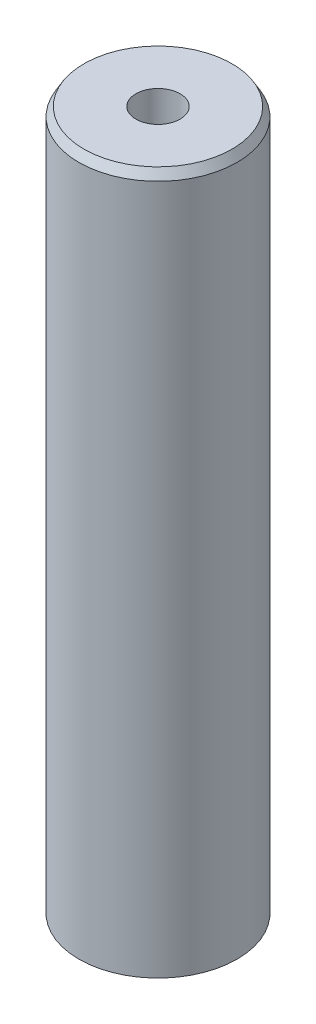
ISO-10303-21;
HEADER;
FILE_DESCRIPTION(('STEP AP214'),'2;1');
FILE_NAME('part.step','',(''),(''),'','','');
FILE_SCHEMA(('AUTOMOTIVE_DESIGN { 1 0 10303 214 1 1 1 1 }'));
ENDSEC;
DATA;
#1=APPLICATION_CONTEXT('core data for automotive mechanical design processes');
#2=APPLICATION_PROTOCOL_DEFINITION('international standard','automotive_design',2000,#1);
#3=PRODUCT_CONTEXT('',#1,'mechanical');
#4=PRODUCT('Part','Part','',(#3));
#5=PRODUCT_RELATED_PRODUCT_CATEGORY('part','',(#4));
#6=PRODUCT_DEFINITION_FORMATION('','',#4);
#7=PRODUCT_DEFINITION_CONTEXT('part definition',#1,'design');
#8=PRODUCT_DEFINITION('design','',#6,#7);
#9=PRODUCT_DEFINITION_SHAPE('','',#8);
#10=(LENGTH_UNIT() NAMED_UNIT(*) SI_UNIT(.MILLI.,.METRE.));
#11=(NAMED_UNIT(*) PLANE_ANGLE_UNIT() SI_UNIT($,.RADIAN.));
#12=(NAMED_UNIT(*) SI_UNIT($,.STERADIAN.) SOLID_ANGLE_UNIT());
#13=UNCERTAINTY_MEASURE_WITH_UNIT(LENGTH_MEASURE(1.E-05),#10,'distance_accuracy_value','');
#14=(GEOMETRIC_REPRESENTATION_CONTEXT(3) GLOBAL_UNCERTAINTY_ASSIGNED_CONTEXT((#13)) GLOBAL_UNIT_ASSIGNED_CONTEXT((#10,
#11,#12)) REPRESENTATION_CONTEXT('',''));
#15=CARTESIAN_POINT('',(0.,0.,0.));
#16=DIRECTION('',(0.,0.,1.));
#17=DIRECTION('',(1.,0.,0.));
#18=AXIS2_PLACEMENT_3D('',#15,#16,#17);
#19=CARTESIAN_POINT('',(0.,111.164300151304,0.));
#20=DIRECTION('',(0.,-1.,0.));
#21=DIRECTION('',(0.,0.,-1.));
#22=AXIS2_PLACEMENT_3D('',#19,#20,#21);
#23=CYLINDRICAL_SURFACE('',#22,12.5);
#24=CARTESIAN_POINT('',(0.,109.759396231411,0.));
#25=DIRECTION('',(0.,1.,0.));
#26=DIRECTION('',(0.,0.,1.));
#27=AXIS2_PLACEMENT_3D('',#24,#25,#26);
#28=CIRCLE('',#27,12.5);
#29=CARTESIAN_POINT('',(0.,109.759396231411,12.5));
#30=VERTEX_POINT('',#29);
#31=EDGE_CURVE('E50',#30,#30,#28,.F.);
#32=ORIENTED_EDGE('',*,*,#31,.T.);
#33=EDGE_LOOP('',(#32));
#34=FACE_BOUND('',#33,.T.);
#35=CARTESIAN_POINT('',(0.,0.811121656335706,0.));
#36=DIRECTION('',(0.,1.,0.));
#37=DIRECTION('',(0.,0.,1.));
#38=AXIS2_PLACEMENT_3D('',#35,#36,#37);
#39=CIRCLE('',#38,12.5);
#40=CARTESIAN_POINT('',(0.,0.811121656335706,12.5));
#41=VERTEX_POINT('',#40);
#42=EDGE_CURVE('E51',#41,#41,#39,.T.);
#43=ORIENTED_EDGE('',*,*,#42,.T.);
#44=EDGE_LOOP('',(#43));
#45=FACE_BOUND('',#44,.T.);
#46=ADVANCED_FACE('F39',(#34,#45),#23,.T.);
#47=CARTESIAN_POINT('',(0.,111.164300151304,0.));
#48=DIRECTION('',(0.,1.,0.));
#49=DIRECTION('',(0.,0.,1.));
#50=AXIS2_PLACEMENT_3D('',#47,#48,#49);
#51=PLANE('',#50);
#52=CARTESIAN_POINT('',(0.,111.164300151304,0.));
#53=DIRECTION('',(0.,1.,0.));
#54=DIRECTION('',(0.,0.,1.));
#55=AXIS2_PLACEMENT_3D('',#52,#53,#54);
#56=CIRCLE('',#55,11.6888783436643);
#57=CARTESIAN_POINT('',(0.,111.164300151304,11.6888783436643));
#58=VERTEX_POINT('',#57);
#59=EDGE_CURVE('E54',#58,#58,#56,.T.);
#60=ORIENTED_EDGE('',*,*,#59,.T.);
#61=EDGE_LOOP('',(#60));
#62=FACE_BOUND('',#61,.T.);
#63=CARTESIAN_POINT('',(0.,111.164300151304,0.));
#64=DIRECTION('',(0.,1.,0.));
#65=DIRECTION('',(0.,0.,1.));
#66=AXIS2_PLACEMENT_3D('',#63,#64,#65);
#67=CIRCLE('',#66,3.48511767817071);
#68=CARTESIAN_POINT('',(0.,111.164300151304,3.48511767817071));
#69=VERTEX_POINT('',#68);
#70=EDGE_CURVE('E58',#69,#69,#67,.T.);
#71=ORIENTED_EDGE('',*,*,#70,.F.);
#72=EDGE_LOOP('',(#71));
#73=FACE_BOUND('',#72,.T.);
#74=ADVANCED_FACE('F69',(#62,#73),#51,.T.);
#75=CARTESIAN_POINT('',(0.,0.,0.));
#76=DIRECTION('',(0.,1.,0.));
#77=DIRECTION('',(0.,0.,1.));
#78=AXIS2_PLACEMENT_3D('',#75,#76,#77);
#79=PLANE('',#78);
#80=CARTESIAN_POINT('',(0.,0.,0.));
#81=DIRECTION('',(0.,1.,0.));
#82=DIRECTION('',(0.,0.,1.));
#83=AXIS2_PLACEMENT_3D('',#80,#81,#82);
#84=CIRCLE('',#83,11.0950960801071);
#85=CARTESIAN_POINT('',(0.,0.,11.0950960801071));
#86=VERTEX_POINT('',#85);
#87=EDGE_CURVE('E10',#86,#86,#84,.F.);
#88=ORIENTED_EDGE('',*,*,#87,.T.);
#89=EDGE_LOOP('',(#88));
#90=FACE_BOUND('',#89,.T.);
#91=CARTESIAN_POINT('',(0.,0.,0.));
#92=DIRECTION('',(0.,1.,0.));
#93=DIRECTION('',(0.,0.,1.));
#94=AXIS2_PLACEMENT_3D('',#91,#92,#93);
#95=CIRCLE('',#94,3.48511767817071);
#96=CARTESIAN_POINT('',(0.,0.,3.48511767817071));
#97=VERTEX_POINT('',#96);
#98=EDGE_CURVE('E63',#97,#97,#95,.T.);
#99=ORIENTED_EDGE('',*,*,#98,.T.);
#100=EDGE_LOOP('',(#99));
#101=FACE_BOUND('',#100,.T.);
#102=ADVANCED_FACE('F75',(#90,#101),#79,.F.);
#103=CARTESIAN_POINT('',(0.,111.164300151304,0.));
#104=DIRECTION('',(0.,-1.,0.));
#105=DIRECTION('',(0.,0.,-1.));
#106=AXIS2_PLACEMENT_3D('',#103,#104,#105);
#107=CYLINDRICAL_SURFACE('',#106,3.48511767817071);
#108=ORIENTED_EDGE('',*,*,#70,.T.);
#109=EDGE_LOOP('',(#108));
#110=FACE_BOUND('',#109,.T.);
#111=ORIENTED_EDGE('',*,*,#98,.F.);
#112=EDGE_LOOP('',(#111));
#113=FACE_BOUND('',#112,.T.);
#114=ADVANCED_FACE('F70',(#110,#113),#107,.F.);
#115=CARTESIAN_POINT('',(0.,111.164300151304,0.));
#116=DIRECTION('',(0.,-1.,0.));
#117=DIRECTION('',(0.,0.,-1.));
#118=AXIS2_PLACEMENT_3D('',#115,#116,#117);
#119=CONICAL_SURFACE('',#118,11.6888783436643,0.523598775598301);
#120=ORIENTED_EDGE('',*,*,#31,.F.);
#121=EDGE_LOOP('',(#120));
#122=FACE_BOUND('',#121,.T.);
#123=ORIENTED_EDGE('',*,*,#59,.F.);
#124=EDGE_LOOP('',(#123));
#125=FACE_BOUND('',#124,.T.);
#126=ADVANCED_FACE('F81',(#122,#125),#119,.T.);
#127=CARTESIAN_POINT('',(0.,0.811121656335706,0.));
#128=DIRECTION('',(0.,1.,0.));
#129=DIRECTION('',(0.,0.,1.));
#130=AXIS2_PLACEMENT_3D('',#127,#128,#129);
#131=CONICAL_SURFACE('',#130,12.5,1.0471975511966);
#132=ORIENTED_EDGE('',*,*,#87,.F.);
#133=EDGE_LOOP('',(#132));
#134=FACE_BOUND('',#133,.T.);
#135=ORIENTED_EDGE('',*,*,#42,.F.);
#136=EDGE_LOOP('',(#135));
#137=FACE_BOUND('',#136,.T.);
#138=ADVANCED_FACE('F45',(#134,#137),#131,.T.);
#139=CLOSED_SHELL('',(#46,#74,#102,#114,#126,#138));
#140=MANIFOLD_SOLID_BREP('B2',#139);
#141=ADVANCED_BREP_SHAPE_REPRESENTATION('',(#18,#140),#14);
#142=SHAPE_DEFINITION_REPRESENTATION(#9,#141);
ENDSEC;
END-ISO-10303-21;
